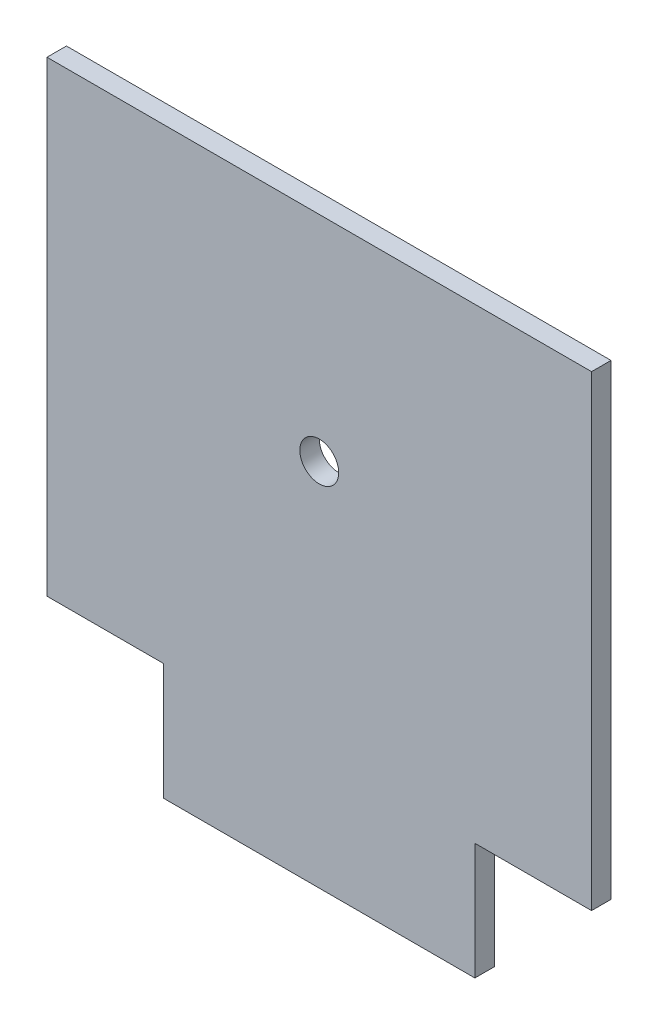
ISO-10303-21;
HEADER;
FILE_DESCRIPTION(('STEP AP214'),'2;1');
FILE_NAME('part.step','',(''),(''),'','','');
FILE_SCHEMA(('AUTOMOTIVE_DESIGN { 1 0 10303 214 1 1 1 1 }'));
ENDSEC;
DATA;
#1=APPLICATION_CONTEXT('core data for automotive mechanical design processes');
#2=APPLICATION_PROTOCOL_DEFINITION('international standard','automotive_design',2000,#1);
#3=PRODUCT_CONTEXT('',#1,'mechanical');
#4=PRODUCT('Part','Part','',(#3));
#5=PRODUCT_RELATED_PRODUCT_CATEGORY('part','',(#4));
#6=PRODUCT_DEFINITION_FORMATION('','',#4);
#7=PRODUCT_DEFINITION_CONTEXT('part definition',#1,'design');
#8=PRODUCT_DEFINITION('design','',#6,#7);
#9=PRODUCT_DEFINITION_SHAPE('','',#8);
#10=(LENGTH_UNIT() NAMED_UNIT(*) SI_UNIT(.MILLI.,.METRE.));
#11=(NAMED_UNIT(*) PLANE_ANGLE_UNIT() SI_UNIT($,.RADIAN.));
#12=(NAMED_UNIT(*) SI_UNIT($,.STERADIAN.) SOLID_ANGLE_UNIT());
#13=UNCERTAINTY_MEASURE_WITH_UNIT(LENGTH_MEASURE(1.E-05),#10,'distance_accuracy_value','');
#14=(GEOMETRIC_REPRESENTATION_CONTEXT(3) GLOBAL_UNCERTAINTY_ASSIGNED_CONTEXT((#13)) GLOBAL_UNIT_ASSIGNED_CONTEXT((#10,
#11,#12)) REPRESENTATION_CONTEXT('',''));
#15=CARTESIAN_POINT('',(0.,0.,0.));
#16=DIRECTION('',(0.,0.,1.));
#17=DIRECTION('',(1.,0.,0.));
#18=AXIS2_PLACEMENT_3D('',#15,#16,#17);
#19=CARTESIAN_POINT('',(0.,380.999999999962,6.35));
#20=DIRECTION('',(0.,1.,0.));
#21=DIRECTION('',(0.,0.,1.));
#22=AXIS2_PLACEMENT_3D('',#19,#20,#21);
#23=PLANE('',#22);
#24=DIRECTION('',(0.,0.,-1.));
#25=VECTOR('',#24,1.);
#26=CARTESIAN_POINT('',(808.559999999964,380.999999999962,6.35));
#27=LINE('',#26,#25);
#28=CARTESIAN_POINT('',(808.559999999964,380.999999999962,6.35));
#29=VERTEX_POINT('',#28);
#30=CARTESIAN_POINT('',(808.559999999964,380.999999999962,-6.35));
#31=VERTEX_POINT('',#30);
#32=EDGE_CURVE('E164',#29,#31,#27,.T.);
#33=ORIENTED_EDGE('',*,*,#32,.F.);
#34=DIRECTION('',(1.,0.,0.));
#35=VECTOR('',#34,1.);
#36=CARTESIAN_POINT('',(0.,380.999999999962,6.35));
#37=LINE('',#36,#35);
#38=CARTESIAN_POINT('',(732.359999999964,380.999999999962,6.35));
#39=VERTEX_POINT('',#38);
#40=EDGE_CURVE('E155',#39,#29,#37,.T.);
#41=ORIENTED_EDGE('',*,*,#40,.F.);
#42=DIRECTION('',(0.,0.,-1.));
#43=VECTOR('',#42,1.);
#44=CARTESIAN_POINT('',(732.359999999964,380.999999999962,6.35));
#45=LINE('',#44,#43);
#46=CARTESIAN_POINT('',(732.359999999964,380.999999999962,-6.35));
#47=VERTEX_POINT('',#46);
#48=EDGE_CURVE('E196',#39,#47,#45,.T.);
#49=ORIENTED_EDGE('',*,*,#48,.T.);
#50=DIRECTION('',(1.,0.,0.));
#51=VECTOR('',#50,1.);
#52=CARTESIAN_POINT('',(0.,380.999999999962,-6.35));
#53=LINE('',#52,#51);
#54=EDGE_CURVE('E189',#47,#31,#53,.T.);
#55=ORIENTED_EDGE('',*,*,#54,.T.);
#56=EDGE_LOOP('',(#33,#41,#49,#55));
#57=FACE_BOUND('',#56,.T.);
#58=ADVANCED_FACE('F45',(#57),#23,.F.);
#59=DIRECTION('',(0.,0.,1.));
#60=VECTOR('',#59,1.);
#61=CARTESIAN_POINT('',(1011.75999999996,380.999999999962,6.35));
#62=LINE('',#61,#60);
#63=CARTESIAN_POINT('',(1011.75999999996,380.999999999962,-6.35));
#64=VERTEX_POINT('',#63);
#65=CARTESIAN_POINT('',(1011.75999999996,380.999999999962,6.35));
#66=VERTEX_POINT('',#65);
#67=EDGE_CURVE('E169',#64,#66,#62,.T.);
#68=ORIENTED_EDGE('',*,*,#67,.F.);
#69=CARTESIAN_POINT('',(1087.95999999996,380.999999999962,-6.35));
#70=VERTEX_POINT('',#69);
#71=EDGE_CURVE('E115',#64,#70,#53,.T.);
#72=ORIENTED_EDGE('',*,*,#71,.T.);
#73=DIRECTION('',(0.,0.,-1.));
#74=VECTOR('',#73,1.);
#75=CARTESIAN_POINT('',(1087.95999999996,380.999999999962,6.35));
#76=LINE('',#75,#74);
#77=CARTESIAN_POINT('',(1087.95999999996,380.999999999962,6.35));
#78=VERTEX_POINT('',#77);
#79=EDGE_CURVE('E145',#78,#70,#76,.T.);
#80=ORIENTED_EDGE('',*,*,#79,.F.);
#81=EDGE_CURVE('E85',#66,#78,#37,.T.);
#82=ORIENTED_EDGE('',*,*,#81,.F.);
#83=EDGE_LOOP('',(#68,#72,#80,#82));
#84=FACE_BOUND('',#83,.T.);
#85=ADVANCED_FACE('F207',(#84),#23,.F.);
#86=CARTESIAN_POINT('',(-1.41063631364129E-12,685.79999999996,6.35));
#87=DIRECTION('',(0.,1.,0.));
#88=DIRECTION('',(-1.,0.,0.));
#89=AXIS2_PLACEMENT_3D('',#86,#87,#88);
#90=PLANE('',#89);
#91=DIRECTION('',(1.,0.,0.));
#92=VECTOR('',#91,1.);
#93=CARTESIAN_POINT('',(-1.41063631364129E-12,685.79999999996,-6.35));
#94=LINE('',#93,#92);
#95=CARTESIAN_POINT('',(732.359999999964,685.799999999962,-6.35));
#96=VERTEX_POINT('',#95);
#97=CARTESIAN_POINT('',(1087.95999999996,685.799999999962,-6.35));
#98=VERTEX_POINT('',#97);
#99=EDGE_CURVE('E153',#96,#98,#94,.T.);
#100=ORIENTED_EDGE('',*,*,#99,.F.);
#101=DIRECTION('',(0.,0.,-1.));
#102=VECTOR('',#101,1.);
#103=CARTESIAN_POINT('',(732.359999999964,685.799999999962,6.35));
#104=LINE('',#103,#102);
#105=CARTESIAN_POINT('',(732.359999999964,685.799999999962,6.35));
#106=VERTEX_POINT('',#105);
#107=EDGE_CURVE('E102',#106,#96,#104,.T.);
#108=ORIENTED_EDGE('',*,*,#107,.F.);
#109=DIRECTION('',(1.,0.,0.));
#110=VECTOR('',#109,1.);
#111=CARTESIAN_POINT('',(-1.41063631364129E-12,685.79999999996,6.35));
#112=LINE('',#111,#110);
#113=CARTESIAN_POINT('',(1087.95999999996,685.799999999962,6.35));
#114=VERTEX_POINT('',#113);
#115=EDGE_CURVE('E138',#106,#114,#112,.T.);
#116=ORIENTED_EDGE('',*,*,#115,.T.);
#117=DIRECTION('',(0.,0.,-1.));
#118=VECTOR('',#117,1.);
#119=CARTESIAN_POINT('',(1087.95999999996,685.799999999962,6.35));
#120=LINE('',#119,#118);
#121=EDGE_CURVE('E130',#114,#98,#120,.T.);
#122=ORIENTED_EDGE('',*,*,#121,.T.);
#123=EDGE_LOOP('',(#100,#108,#116,#122));
#124=FACE_BOUND('',#123,.T.);
#125=ADVANCED_FACE('F141',(#124),#90,.T.);
#126=CARTESIAN_POINT('',(732.359999999964,0.,6.35));
#127=DIRECTION('',(1.,0.,0.));
#128=DIRECTION('',(0.,0.,-1.));
#129=AXIS2_PLACEMENT_3D('',#126,#127,#128);
#130=PLANE('',#129);
#131=DIRECTION('',(0.,-1.,0.));
#132=VECTOR('',#131,1.);
#133=CARTESIAN_POINT('',(732.359999999964,0.,-6.35));
#134=LINE('',#133,#132);
#135=EDGE_CURVE('E137',#96,#47,#134,.T.);
#136=ORIENTED_EDGE('',*,*,#135,.T.);
#137=ORIENTED_EDGE('',*,*,#48,.F.);
#138=DIRECTION('',(0.,-1.,0.));
#139=VECTOR('',#138,1.);
#140=CARTESIAN_POINT('',(732.359999999964,0.,6.35));
#141=LINE('',#140,#139);
#142=EDGE_CURVE('E159',#106,#39,#141,.T.);
#143=ORIENTED_EDGE('',*,*,#142,.F.);
#144=ORIENTED_EDGE('',*,*,#107,.T.);
#145=EDGE_LOOP('',(#136,#137,#143,#144));
#146=FACE_BOUND('',#145,.T.);
#147=ADVANCED_FACE('F197',(#146),#130,.F.);
#148=CARTESIAN_POINT('',(1087.95999999996,0.,6.35));
#149=DIRECTION('',(1.,0.,0.));
#150=DIRECTION('',(0.,0.,-1.));
#151=AXIS2_PLACEMENT_3D('',#148,#149,#150);
#152=PLANE('',#151);
#153=DIRECTION('',(0.,-1.,0.));
#154=VECTOR('',#153,1.);
#155=CARTESIAN_POINT('',(1087.95999999996,0.,-6.35));
#156=LINE('',#155,#154);
#157=EDGE_CURVE('E134',#98,#70,#156,.T.);
#158=ORIENTED_EDGE('',*,*,#157,.F.);
#159=ORIENTED_EDGE('',*,*,#121,.F.);
#160=DIRECTION('',(0.,-1.,0.));
#161=VECTOR('',#160,1.);
#162=CARTESIAN_POINT('',(1087.95999999996,0.,6.35));
#163=LINE('',#162,#161);
#164=EDGE_CURVE('E132',#114,#78,#163,.T.);
#165=ORIENTED_EDGE('',*,*,#164,.T.);
#166=ORIENTED_EDGE('',*,*,#79,.T.);
#167=EDGE_LOOP('',(#158,#159,#165,#166));
#168=FACE_BOUND('',#167,.T.);
#169=ADVANCED_FACE('F131',(#168),#152,.T.);
#170=CARTESIAN_POINT('',(0.,0.,6.35));
#171=DIRECTION('',(0.,0.,1.));
#172=DIRECTION('',(1.,0.,0.));
#173=AXIS2_PLACEMENT_3D('',#170,#171,#172);
#174=PLANE('',#173);
#175=CARTESIAN_POINT('',(910.15999999998,546.099999999962,6.34999999999999));
#176=DIRECTION('',(0.,0.,1.));
#177=DIRECTION('',(1.,0.,0.));
#178=AXIS2_PLACEMENT_3D('',#175,#176,#177);
#179=CIRCLE('',#178,12.7);
#180=CARTESIAN_POINT('',(922.85999999998,546.099999999962,6.34999999999999));
#181=VERTEX_POINT('',#180);
#182=EDGE_CURVE('E49',#181,#181,#179,.F.);
#183=ORIENTED_EDGE('',*,*,#182,.T.);
#184=EDGE_LOOP('',(#183));
#185=FACE_BOUND('',#184,.T.);
#186=ORIENTED_EDGE('',*,*,#115,.F.);
#187=ORIENTED_EDGE('',*,*,#142,.T.);
#188=ORIENTED_EDGE('',*,*,#40,.T.);
#189=DIRECTION('',(0.,1.,0.));
#190=VECTOR('',#189,1.);
#191=CARTESIAN_POINT('',(808.559999999964,304.799999999962,6.35));
#192=LINE('',#191,#190);
#193=CARTESIAN_POINT('',(808.559999999964,304.799999999962,6.35));
#194=VERTEX_POINT('',#193);
#195=EDGE_CURVE('E171',#194,#29,#192,.T.);
#196=ORIENTED_EDGE('',*,*,#195,.F.);
#197=DIRECTION('',(-1.,0.,0.));
#198=VECTOR('',#197,1.);
#199=CARTESIAN_POINT('',(808.559999999964,304.799999999962,6.35));
#200=LINE('',#199,#198);
#201=CARTESIAN_POINT('',(1011.75999999996,304.799999999962,6.35));
#202=VERTEX_POINT('',#201);
#203=EDGE_CURVE('E56',#202,#194,#200,.T.);
#204=ORIENTED_EDGE('',*,*,#203,.F.);
#205=DIRECTION('',(0.,1.,0.));
#206=VECTOR('',#205,1.);
#207=CARTESIAN_POINT('',(1011.75999999996,304.799999999962,6.35));
#208=LINE('',#207,#206);
#209=EDGE_CURVE('E158',#202,#66,#208,.T.);
#210=ORIENTED_EDGE('',*,*,#209,.T.);
#211=ORIENTED_EDGE('',*,*,#81,.T.);
#212=ORIENTED_EDGE('',*,*,#164,.F.);
#213=EDGE_LOOP('',(#186,#187,#188,#196,#204,#210,#211,#212));
#214=FACE_BOUND('',#213,.T.);
#215=ADVANCED_FACE('F47',(#185,#214),#174,.T.);
#216=CARTESIAN_POINT('',(0.,0.,-6.35));
#217=DIRECTION('',(0.,0.,1.));
#218=DIRECTION('',(1.,0.,0.));
#219=AXIS2_PLACEMENT_3D('',#216,#217,#218);
#220=PLANE('',#219);
#221=CARTESIAN_POINT('',(910.15999999998,546.099999999962,-6.34999999999999));
#222=DIRECTION('',(0.,0.,1.));
#223=DIRECTION('',(1.,0.,0.));
#224=AXIS2_PLACEMENT_3D('',#221,#222,#223);
#225=CIRCLE('',#224,12.7);
#226=CARTESIAN_POINT('',(922.85999999998,546.099999999962,-6.34999999999999));
#227=VERTEX_POINT('',#226);
#228=EDGE_CURVE('E11',#227,#227,#225,.F.);
#229=ORIENTED_EDGE('',*,*,#228,.F.);
#230=EDGE_LOOP('',(#229));
#231=FACE_BOUND('',#230,.T.);
#232=ORIENTED_EDGE('',*,*,#99,.T.);
#233=ORIENTED_EDGE('',*,*,#157,.T.);
#234=ORIENTED_EDGE('',*,*,#71,.F.);
#235=DIRECTION('',(0.,1.,0.));
#236=VECTOR('',#235,1.);
#237=CARTESIAN_POINT('',(1011.75999999996,304.799999999962,-6.35));
#238=LINE('',#237,#236);
#239=CARTESIAN_POINT('',(1011.75999999996,304.799999999962,-6.35));
#240=VERTEX_POINT('',#239);
#241=EDGE_CURVE('E165',#240,#64,#238,.T.);
#242=ORIENTED_EDGE('',*,*,#241,.F.);
#243=DIRECTION('',(1.,0.,0.));
#244=VECTOR('',#243,1.);
#245=CARTESIAN_POINT('',(808.559999999964,304.799999999962,-6.35));
#246=LINE('',#245,#244);
#247=CARTESIAN_POINT('',(808.559999999964,304.799999999962,-6.35));
#248=VERTEX_POINT('',#247);
#249=EDGE_CURVE('E73',#248,#240,#246,.T.);
#250=ORIENTED_EDGE('',*,*,#249,.F.);
#251=DIRECTION('',(0.,1.,0.));
#252=VECTOR('',#251,1.);
#253=CARTESIAN_POINT('',(808.559999999964,304.799999999962,-6.35));
#254=LINE('',#253,#252);
#255=EDGE_CURVE('E162',#248,#31,#254,.T.);
#256=ORIENTED_EDGE('',*,*,#255,.T.);
#257=ORIENTED_EDGE('',*,*,#54,.F.);
#258=ORIENTED_EDGE('',*,*,#135,.F.);
#259=EDGE_LOOP('',(#232,#233,#234,#242,#250,#256,#257,#258));
#260=FACE_BOUND('',#259,.T.);
#261=ADVANCED_FACE('F187',(#231,#260),#220,.F.);
#262=CARTESIAN_POINT('',(808.559999999964,304.799999999962,6.35));
#263=DIRECTION('',(1.,0.,0.));
#264=DIRECTION('',(0.,0.,-1.));
#265=AXIS2_PLACEMENT_3D('',#262,#263,#264);
#266=PLANE('',#265);
#267=ORIENTED_EDGE('',*,*,#32,.T.);
#268=ORIENTED_EDGE('',*,*,#255,.F.);
#269=DIRECTION('',(0.,0.,-1.));
#270=VECTOR('',#269,1.);
#271=CARTESIAN_POINT('',(808.559999999964,304.799999999962,6.35));
#272=LINE('',#271,#270);
#273=EDGE_CURVE('E168',#194,#248,#272,.T.);
#274=ORIENTED_EDGE('',*,*,#273,.F.);
#275=ORIENTED_EDGE('',*,*,#195,.T.);
#276=EDGE_LOOP('',(#267,#268,#274,#275));
#277=FACE_BOUND('',#276,.T.);
#278=ADVANCED_FACE('F184',(#277),#266,.F.);
#279=CARTESIAN_POINT('',(1011.75999999996,304.799999999962,6.35));
#280=DIRECTION('',(-1.,0.,0.));
#281=DIRECTION('',(0.,0.,1.));
#282=AXIS2_PLACEMENT_3D('',#279,#280,#281);
#283=PLANE('',#282);
#284=ORIENTED_EDGE('',*,*,#67,.T.);
#285=ORIENTED_EDGE('',*,*,#209,.F.);
#286=DIRECTION('',(0.,0.,1.));
#287=VECTOR('',#286,1.);
#288=CARTESIAN_POINT('',(1011.75999999996,304.799999999962,6.35));
#289=LINE('',#288,#287);
#290=EDGE_CURVE('E178',#240,#202,#289,.T.);
#291=ORIENTED_EDGE('',*,*,#290,.F.);
#292=ORIENTED_EDGE('',*,*,#241,.T.);
#293=EDGE_LOOP('',(#284,#285,#291,#292));
#294=FACE_BOUND('',#293,.T.);
#295=ADVANCED_FACE('F205',(#294),#283,.F.);
#296=CARTESIAN_POINT('',(0.,304.799999999962,0.));
#297=DIRECTION('',(0.,-1.,0.));
#298=DIRECTION('',(0.,0.,-1.));
#299=AXIS2_PLACEMENT_3D('',#296,#297,#298);
#300=PLANE('',#299);
#301=ORIENTED_EDGE('',*,*,#273,.T.);
#302=ORIENTED_EDGE('',*,*,#249,.T.);
#303=ORIENTED_EDGE('',*,*,#290,.T.);
#304=ORIENTED_EDGE('',*,*,#203,.T.);
#305=EDGE_LOOP('',(#301,#302,#303,#304));
#306=FACE_BOUND('',#305,.T.);
#307=ADVANCED_FACE('F182',(#306),#300,.T.);
#308=CARTESIAN_POINT('',(910.159999999983,546.099999999962,-200.));
#309=DIRECTION('',(0.,0.,1.));
#310=DIRECTION('',(1.,0.,0.));
#311=AXIS2_PLACEMENT_3D('',#308,#309,#310);
#312=CYLINDRICAL_SURFACE('',#311,12.7);
#313=ORIENTED_EDGE('',*,*,#182,.F.);
#314=EDGE_LOOP('',(#313));
#315=FACE_BOUND('',#314,.T.);
#316=ORIENTED_EDGE('',*,*,#228,.T.);
#317=EDGE_LOOP('',(#316));
#318=FACE_BOUND('',#317,.T.);
#319=ADVANCED_FACE('F225',(#315,#318),#312,.F.);
#320=CLOSED_SHELL('',(#58,#85,#125,#147,#169,#215,#261,#278,#295,#307,#319));
#321=MANIFOLD_SOLID_BREP('B2',#320);
#322=ADVANCED_BREP_SHAPE_REPRESENTATION('',(#18,#321),#14);
#323=SHAPE_DEFINITION_REPRESENTATION(#9,#322);
ENDSEC;
END-ISO-10303-21;
